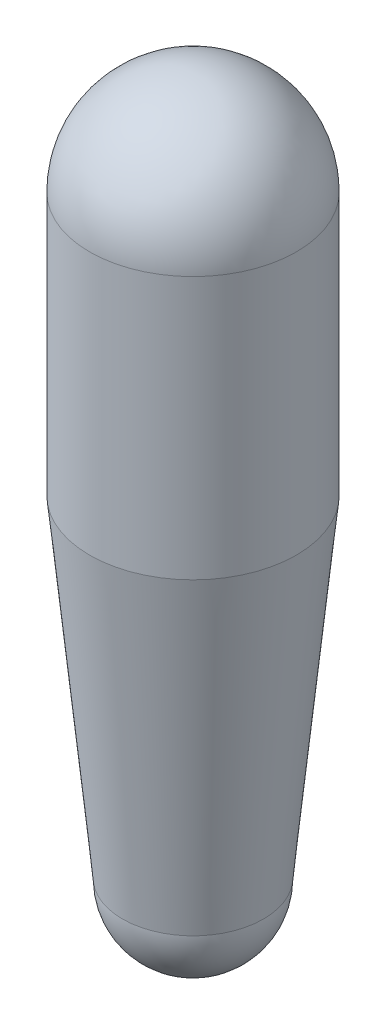
ISO-10303-21;
HEADER;
FILE_DESCRIPTION(('STEP AP214'),'2;1');
FILE_NAME('part.step','',(''),(''),'','','');
FILE_SCHEMA(('AUTOMOTIVE_DESIGN { 1 0 10303 214 1 1 1 1 }'));
ENDSEC;
DATA;
#1=APPLICATION_CONTEXT('core data for automotive mechanical design processes');
#2=APPLICATION_PROTOCOL_DEFINITION('international standard','automotive_design',2000,#1);
#3=PRODUCT_CONTEXT('',#1,'mechanical');
#4=PRODUCT('Part','Part','',(#3));
#5=PRODUCT_RELATED_PRODUCT_CATEGORY('part','',(#4));
#6=PRODUCT_DEFINITION_FORMATION('','',#4);
#7=PRODUCT_DEFINITION_CONTEXT('part definition',#1,'design');
#8=PRODUCT_DEFINITION('design','',#6,#7);
#9=PRODUCT_DEFINITION_SHAPE('','',#8);
#10=(LENGTH_UNIT() NAMED_UNIT(*) SI_UNIT(.MILLI.,.METRE.));
#11=(NAMED_UNIT(*) PLANE_ANGLE_UNIT() SI_UNIT($,.RADIAN.));
#12=(NAMED_UNIT(*) SI_UNIT($,.STERADIAN.) SOLID_ANGLE_UNIT());
#13=UNCERTAINTY_MEASURE_WITH_UNIT(LENGTH_MEASURE(1.E-05),#10,'distance_accuracy_value','');
#14=(GEOMETRIC_REPRESENTATION_CONTEXT(3) GLOBAL_UNCERTAINTY_ASSIGNED_CONTEXT((#13)) GLOBAL_UNIT_ASSIGNED_CONTEXT((#10,
#11,#12)) REPRESENTATION_CONTEXT('',''));
#15=CARTESIAN_POINT('',(0.,0.,0.));
#16=DIRECTION('',(0.,0.,1.));
#17=DIRECTION('',(1.,0.,0.));
#18=AXIS2_PLACEMENT_3D('',#15,#16,#17);
#19=CARTESIAN_POINT('',(0.,0.,0.));
#20=DIRECTION('',(-1.,0.,0.));
#21=DIRECTION('',(0.,1.,0.));
#22=AXIS2_PLACEMENT_3D('',#19,#20,#21);
#23=SPHERICAL_SURFACE('',#22,80.01);
#24=CARTESIAN_POINT('',(0.,0.,0.));
#25=DIRECTION('',(0.,1.,0.));
#26=DIRECTION('',(0.,0.,1.));
#27=AXIS2_PLACEMENT_3D('',#24,#25,#26);
#28=SPHERICAL_SURFACE('',#27,80.01);
#29=CARTESIAN_POINT('',(0.,0.,0.));
#30=DIRECTION('',(0.,1.,0.));
#31=DIRECTION('',(0.,0.,1.));
#32=AXIS2_PLACEMENT_3D('',#29,#30,#31);
#33=CIRCLE('',#32,80.01);
#34=CARTESIAN_POINT('',(0.,0.,80.01));
#35=VERTEX_POINT('',#34);
#36=EDGE_CURVE('E10',#35,#35,#33,.F.);
#37=ORIENTED_EDGE('',*,*,#36,.F.);
#38=EDGE_LOOP('',(#37));
#39=FACE_BOUND('',#38,.T.);
#40=ADVANCED_FACE('F14',(#39),#28,.T.);
#41=CARTESIAN_POINT('',(0.,-459.74,0.));
#42=DIRECTION('',(0.,1.,0.));
#43=DIRECTION('',(0.,0.,1.));
#44=AXIS2_PLACEMENT_3D('',#41,#42,#43);
#45=CONICAL_SURFACE('',#44,54.61,0.0986882606484066);
#46=CARTESIAN_POINT('',(0.,-203.2,0.));
#47=DIRECTION('',(0.,1.,0.));
#48=DIRECTION('',(0.,0.,1.));
#49=AXIS2_PLACEMENT_3D('',#46,#47,#48);
#50=CIRCLE('',#49,80.01);
#51=CARTESIAN_POINT('',(0.,-203.2,80.01));
#52=VERTEX_POINT('',#51);
#53=EDGE_CURVE('E20',#52,#52,#50,.T.);
#54=ORIENTED_EDGE('',*,*,#53,.F.);
#55=EDGE_LOOP('',(#54));
#56=FACE_BOUND('',#55,.T.);
#57=CARTESIAN_POINT('',(0.,-459.74,0.));
#58=DIRECTION('',(0.,-1.,0.));
#59=DIRECTION('',(0.,0.,-1.));
#60=AXIS2_PLACEMENT_3D('',#57,#58,#59);
#61=CIRCLE('',#60,54.6099999999999);
#62=CARTESIAN_POINT('',(0.,-459.74,-54.6099999999999));
#63=VERTEX_POINT('',#62);
#64=EDGE_CURVE('E24',#63,#63,#61,.F.);
#65=ORIENTED_EDGE('',*,*,#64,.T.);
#66=EDGE_LOOP('',(#65));
#67=FACE_BOUND('',#66,.T.);
#68=ADVANCED_FACE('F31',(#56,#67),#45,.T.);
#69=CARTESIAN_POINT('',(0.,0.,0.));
#70=DIRECTION('',(0.,1.,0.));
#71=DIRECTION('',(0.,0.,1.));
#72=AXIS2_PLACEMENT_3D('',#69,#70,#71);
#73=CYLINDRICAL_SURFACE('',#72,80.01);
#74=ORIENTED_EDGE('',*,*,#36,.T.);
#75=EDGE_LOOP('',(#74));
#76=FACE_BOUND('',#75,.T.);
#77=ORIENTED_EDGE('',*,*,#53,.T.);
#78=EDGE_LOOP('',(#77));
#79=FACE_BOUND('',#78,.T.);
#80=ADVANCED_FACE('F35',(#76,#79),#73,.T.);
#81=CARTESIAN_POINT('',(0.,-459.74,0.));
#82=DIRECTION('',(-1.,0.,0.));
#83=DIRECTION('',(0.,1.,0.));
#84=AXIS2_PLACEMENT_3D('',#81,#82,#83);
#85=SPHERICAL_SURFACE('',#84,54.61);
#86=CARTESIAN_POINT('',(0.,-459.74,0.));
#87=DIRECTION('',(0.,-1.,0.));
#88=DIRECTION('',(0.,0.,-1.));
#89=AXIS2_PLACEMENT_3D('',#86,#87,#88);
#90=SPHERICAL_SURFACE('',#89,54.61);
#91=ORIENTED_EDGE('',*,*,#64,.F.);
#92=EDGE_LOOP('',(#91));
#93=FACE_BOUND('',#92,.T.);
#94=ADVANCED_FACE('F33',(#93),#90,.T.);
#95=CLOSED_SHELL('',(#40,#68,#80,#94));
#96=MANIFOLD_SOLID_BREP('B1',#95);
#97=ADVANCED_BREP_SHAPE_REPRESENTATION('',(#18,#96),#14);
#98=SHAPE_DEFINITION_REPRESENTATION(#9,#97);
ENDSEC;
END-ISO-10303-21;
